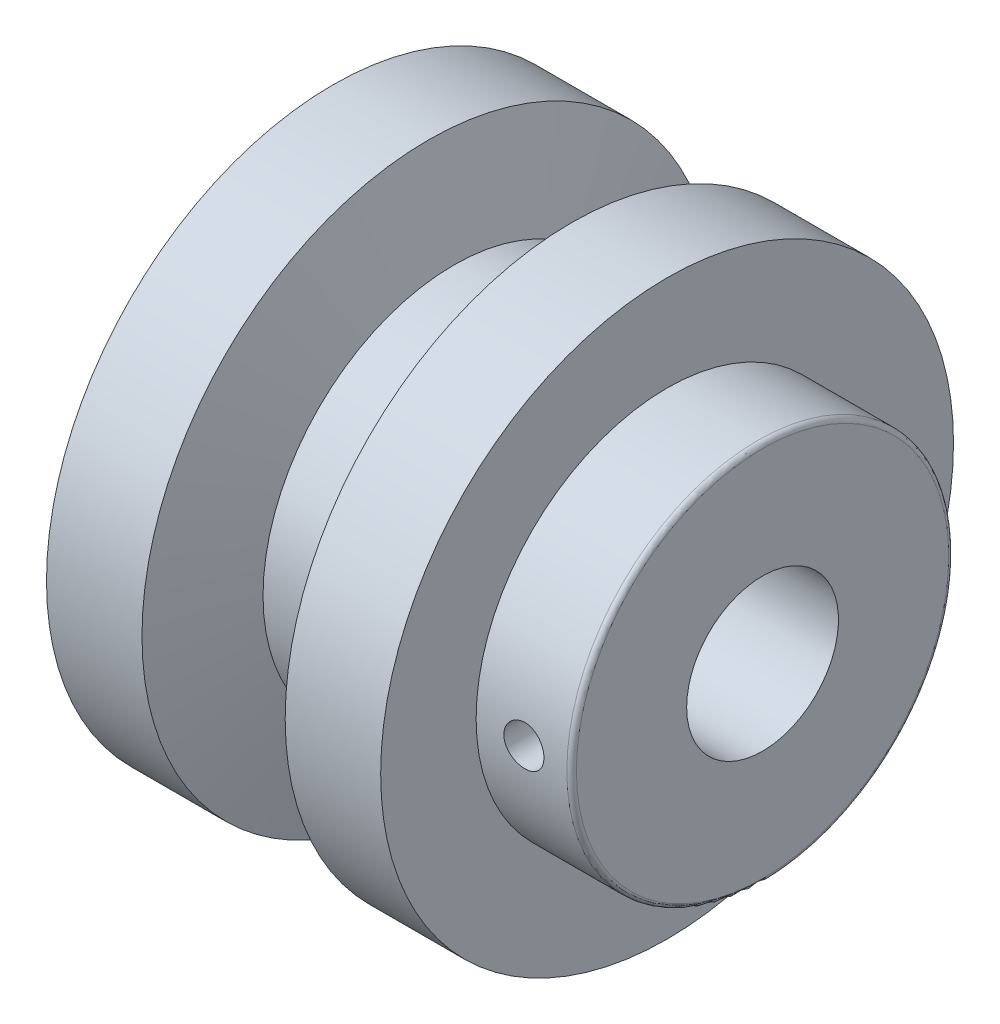
ISO-10303-21;
HEADER;
FILE_DESCRIPTION(('STEP AP214'),'2;1');
FILE_NAME('part.step','',(''),(''),'','','');
FILE_SCHEMA(('AUTOMOTIVE_DESIGN { 1 0 10303 214 1 1 1 1 }'));
ENDSEC;
DATA;
#1=APPLICATION_CONTEXT('core data for automotive mechanical design processes');
#2=APPLICATION_PROTOCOL_DEFINITION('international standard','automotive_design',2000,#1);
#3=PRODUCT_CONTEXT('',#1,'mechanical');
#4=PRODUCT('Part','Part','',(#3));
#5=PRODUCT_RELATED_PRODUCT_CATEGORY('part','',(#4));
#6=PRODUCT_DEFINITION_FORMATION('','',#4);
#7=PRODUCT_DEFINITION_CONTEXT('part definition',#1,'design');
#8=PRODUCT_DEFINITION('design','',#6,#7);
#9=PRODUCT_DEFINITION_SHAPE('','',#8);
#10=(LENGTH_UNIT() NAMED_UNIT(*) SI_UNIT(.MILLI.,.METRE.));
#11=(NAMED_UNIT(*) PLANE_ANGLE_UNIT() SI_UNIT($,.RADIAN.));
#12=(NAMED_UNIT(*) SI_UNIT($,.STERADIAN.) SOLID_ANGLE_UNIT());
#13=UNCERTAINTY_MEASURE_WITH_UNIT(LENGTH_MEASURE(1.E-05),#10,'distance_accuracy_value','');
#14=(GEOMETRIC_REPRESENTATION_CONTEXT(3) GLOBAL_UNCERTAINTY_ASSIGNED_CONTEXT((#13)) GLOBAL_UNIT_ASSIGNED_CONTEXT((#10,
#11,#12)) REPRESENTATION_CONTEXT('',''));
#15=CARTESIAN_POINT('',(0.,0.,0.));
#16=DIRECTION('',(0.,0.,1.));
#17=DIRECTION('',(1.,0.,0.));
#18=AXIS2_PLACEMENT_3D('',#15,#16,#17);
#19=CARTESIAN_POINT('',(2.5,0.,0.));
#20=DIRECTION('',(-1.,0.,0.));
#21=DIRECTION('',(0.,0.,1.));
#22=AXIS2_PLACEMENT_3D('',#19,#20,#21);
#23=CONICAL_SURFACE('',#22,7.95000000000001,1.32581766366803);
#24=CARTESIAN_POINT('',(0.,0.,0.));
#25=DIRECTION('',(-1.,0.,0.));
#26=DIRECTION('',(0.,0.,1.));
#27=AXIS2_PLACEMENT_3D('',#24,#25,#26);
#28=CIRCLE('',#27,17.95);
#29=CARTESIAN_POINT('',(0.,0.,17.95));
#30=VERTEX_POINT('',#29);
#31=EDGE_CURVE('E10',#30,#30,#28,.T.);
#32=ORIENTED_EDGE('',*,*,#31,.T.);
#33=EDGE_LOOP('',(#32));
#34=FACE_BOUND('',#33,.T.);
#35=CARTESIAN_POINT('',(2.5,0.,0.));
#36=DIRECTION('',(-1.,0.,0.));
#37=DIRECTION('',(0.,0.,1.));
#38=AXIS2_PLACEMENT_3D('',#35,#36,#37);
#39=CIRCLE('',#38,7.95000000000001);
#40=CARTESIAN_POINT('',(2.5,0.,7.95000000000001));
#41=VERTEX_POINT('',#40);
#42=EDGE_CURVE('E77',#41,#41,#39,.T.);
#43=ORIENTED_EDGE('',*,*,#42,.F.);
#44=EDGE_LOOP('',(#43));
#45=FACE_BOUND('',#44,.T.);
#46=ADVANCED_FACE('F33',(#34,#45),#23,.F.);
#47=CARTESIAN_POINT('',(0.,-17.95,0.));
#48=DIRECTION('',(-1.,0.,0.));
#49=DIRECTION('',(0.,0.,1.));
#50=AXIS2_PLACEMENT_3D('',#47,#48,#49);
#51=PLANE('',#50);
#52=CARTESIAN_POINT('',(0.,0.,0.));
#53=DIRECTION('',(-1.,0.,0.));
#54=DIRECTION('',(0.,0.,1.));
#55=AXIS2_PLACEMENT_3D('',#52,#53,#54);
#56=CIRCLE('',#55,30.);
#57=CARTESIAN_POINT('',(0.,0.,30.));
#58=VERTEX_POINT('',#57);
#59=EDGE_CURVE('E44',#58,#58,#56,.T.);
#60=ORIENTED_EDGE('',*,*,#59,.T.);
#61=EDGE_LOOP('',(#60));
#62=FACE_BOUND('',#61,.T.);
#63=ORIENTED_EDGE('',*,*,#31,.F.);
#64=EDGE_LOOP('',(#63));
#65=FACE_BOUND('',#64,.T.);
#66=ADVANCED_FACE('F100',(#62,#65),#51,.T.);
#67=CARTESIAN_POINT('',(0.,0.,0.));
#68=DIRECTION('',(-1.,0.,0.));
#69=DIRECTION('',(0.,0.,1.));
#70=AXIS2_PLACEMENT_3D('',#67,#68,#69);
#71=CYLINDRICAL_SURFACE('',#70,30.);
#72=CARTESIAN_POINT('',(10.,0.,0.));
#73=DIRECTION('',(-1.,0.,0.));
#74=DIRECTION('',(0.,0.,1.));
#75=AXIS2_PLACEMENT_3D('',#72,#73,#74);
#76=CIRCLE('',#75,30.);
#77=CARTESIAN_POINT('',(10.,0.,30.));
#78=VERTEX_POINT('',#77);
#79=EDGE_CURVE('E48',#78,#78,#76,.T.);
#80=ORIENTED_EDGE('',*,*,#79,.T.);
#81=EDGE_LOOP('',(#80));
#82=FACE_BOUND('',#81,.T.);
#83=ORIENTED_EDGE('',*,*,#59,.F.);
#84=EDGE_LOOP('',(#83));
#85=FACE_BOUND('',#84,.T.);
#86=ADVANCED_FACE('F104',(#82,#85),#71,.T.);
#87=CARTESIAN_POINT('',(10.,0.,0.));
#88=DIRECTION('',(-1.,0.,0.));
#89=DIRECTION('',(0.,0.,1.));
#90=AXIS2_PLACEMENT_3D('',#87,#88,#89);
#91=CONICAL_SURFACE('',#90,30.,1.30899693899575);
#92=CARTESIAN_POINT('',(12.6794919243112,0.,0.));
#93=DIRECTION('',(-1.,0.,0.));
#94=DIRECTION('',(0.,0.,1.));
#95=AXIS2_PLACEMENT_3D('',#92,#93,#94);
#96=CIRCLE('',#95,20.);
#97=CARTESIAN_POINT('',(12.6794919243112,0.,20.));
#98=VERTEX_POINT('',#97);
#99=EDGE_CURVE('E53',#98,#98,#96,.T.);
#100=ORIENTED_EDGE('',*,*,#99,.T.);
#101=EDGE_LOOP('',(#100));
#102=FACE_BOUND('',#101,.T.);
#103=ORIENTED_EDGE('',*,*,#79,.F.);
#104=EDGE_LOOP('',(#103));
#105=FACE_BOUND('',#104,.T.);
#106=ADVANCED_FACE('F149',(#102,#105),#91,.T.);
#107=CARTESIAN_POINT('',(0.,0.,0.));
#108=DIRECTION('',(-1.,0.,0.));
#109=DIRECTION('',(0.,0.,1.));
#110=AXIS2_PLACEMENT_3D('',#107,#108,#109);
#111=CYLINDRICAL_SURFACE('',#110,20.);
#112=CARTESIAN_POINT('',(22.3205080756888,0.,0.));
#113=DIRECTION('',(-1.,0.,0.));
#114=DIRECTION('',(0.,0.,1.));
#115=AXIS2_PLACEMENT_3D('',#112,#113,#114);
#116=CIRCLE('',#115,20.);
#117=CARTESIAN_POINT('',(22.3205080756888,0.,20.));
#118=VERTEX_POINT('',#117);
#119=EDGE_CURVE('E56',#118,#118,#116,.T.);
#120=ORIENTED_EDGE('',*,*,#119,.T.);
#121=EDGE_LOOP('',(#120));
#122=FACE_BOUND('',#121,.T.);
#123=ORIENTED_EDGE('',*,*,#99,.F.);
#124=EDGE_LOOP('',(#123));
#125=FACE_BOUND('',#124,.T.);
#126=ADVANCED_FACE('F143',(#122,#125),#111,.T.);
#127=CARTESIAN_POINT('',(22.3205080756888,0.,0.));
#128=DIRECTION('',(1.,0.,0.));
#129=DIRECTION('',(0.,0.,-1.));
#130=AXIS2_PLACEMENT_3D('',#127,#128,#129);
#131=CONICAL_SURFACE('',#130,20.,1.30899693899575);
#132=CARTESIAN_POINT('',(25.,0.,0.));
#133=DIRECTION('',(-1.,0.,0.));
#134=DIRECTION('',(0.,0.,1.));
#135=AXIS2_PLACEMENT_3D('',#132,#133,#134);
#136=CIRCLE('',#135,30.);
#137=CARTESIAN_POINT('',(25.,0.,30.));
#138=VERTEX_POINT('',#137);
#139=EDGE_CURVE('E59',#138,#138,#136,.T.);
#140=ORIENTED_EDGE('',*,*,#139,.T.);
#141=EDGE_LOOP('',(#140));
#142=FACE_BOUND('',#141,.T.);
#143=ORIENTED_EDGE('',*,*,#119,.F.);
#144=EDGE_LOOP('',(#143));
#145=FACE_BOUND('',#144,.T.);
#146=ADVANCED_FACE('F137',(#142,#145),#131,.T.);
#147=CARTESIAN_POINT('',(0.,0.,0.));
#148=DIRECTION('',(-1.,0.,0.));
#149=DIRECTION('',(0.,0.,1.));
#150=AXIS2_PLACEMENT_3D('',#147,#148,#149);
#151=CYLINDRICAL_SURFACE('',#150,30.);
#152=CARTESIAN_POINT('',(35.,0.,0.));
#153=DIRECTION('',(-1.,0.,0.));
#154=DIRECTION('',(0.,0.,1.));
#155=AXIS2_PLACEMENT_3D('',#152,#153,#154);
#156=CIRCLE('',#155,30.);
#157=CARTESIAN_POINT('',(35.,0.,30.));
#158=VERTEX_POINT('',#157);
#159=EDGE_CURVE('E62',#158,#158,#156,.T.);
#160=ORIENTED_EDGE('',*,*,#159,.T.);
#161=EDGE_LOOP('',(#160));
#162=FACE_BOUND('',#161,.T.);
#163=ORIENTED_EDGE('',*,*,#139,.F.);
#164=EDGE_LOOP('',(#163));
#165=FACE_BOUND('',#164,.T.);
#166=ADVANCED_FACE('F131',(#162,#165),#151,.T.);
#167=CARTESIAN_POINT('',(35.,-30.,0.));
#168=DIRECTION('',(1.,0.,0.));
#169=DIRECTION('',(0.,0.,-1.));
#170=AXIS2_PLACEMENT_3D('',#167,#168,#169);
#171=PLANE('',#170);
#172=CARTESIAN_POINT('',(35.,0.,0.));
#173=DIRECTION('',(-1.,0.,0.));
#174=DIRECTION('',(0.,0.,1.));
#175=AXIS2_PLACEMENT_3D('',#172,#173,#174);
#176=CIRCLE('',#175,20.);
#177=CARTESIAN_POINT('',(35.,0.,20.));
#178=VERTEX_POINT('',#177);
#179=EDGE_CURVE('E65',#178,#178,#176,.T.);
#180=ORIENTED_EDGE('',*,*,#179,.T.);
#181=EDGE_LOOP('',(#180));
#182=FACE_BOUND('',#181,.T.);
#183=ORIENTED_EDGE('',*,*,#159,.F.);
#184=EDGE_LOOP('',(#183));
#185=FACE_BOUND('',#184,.T.);
#186=ADVANCED_FACE('F125',(#182,#185),#171,.T.);
#187=CARTESIAN_POINT('',(0.,0.,0.));
#188=DIRECTION('',(-1.,0.,0.));
#189=DIRECTION('',(0.,0.,1.));
#190=AXIS2_PLACEMENT_3D('',#187,#188,#189);
#191=CYLINDRICAL_SURFACE('',#190,20.);
#192=CARTESIAN_POINT('',(42.1,0.,20.));
#193=CARTESIAN_POINT('',(42.0999949230642,0.117610574556953,19.9999985861225));
#194=CARTESIAN_POINT('',(42.0900865495256,0.235298131378431,19.9989515701418));
#195=CARTESIAN_POINT('',(42.0507109273298,0.467408281963046,19.9948755007952));
#196=CARTESIAN_POINT('',(42.02122233536,0.581827170618682,19.9918442846137));
#197=CARTESIAN_POINT('',(41.9435561221623,0.804005356961036,19.9841418596598));
#198=CARTESIAN_POINT('',(41.8953900254574,0.911768713849167,19.9794716623513));
#199=CARTESIAN_POINT('',(41.7817589762977,1.11765859904565,19.9690129744413));
#200=CARTESIAN_POINT('',(41.7162973770353,1.2157869902952,19.963224700667));
#201=CARTESIAN_POINT('',(41.569656435472,1.40003175469819,19.9511523144024));
#202=CARTESIAN_POINT('',(41.4884226842205,1.48610471828674,19.944866531453));
#203=CARTESIAN_POINT('',(41.3126596136441,1.64342207671848,19.9325213225088));
#204=CARTESIAN_POINT('',(41.2181296688171,1.71466577354684,19.9264619071801));
#205=CARTESIAN_POINT('',(41.0181837270879,1.84045763756347,19.915238578931));
#206=CARTESIAN_POINT('',(40.9127427088117,1.89496624010398,19.9100768004705));
#207=CARTESIAN_POINT('',(40.6941409242799,1.98548798456523,19.9012541874175));
#208=CARTESIAN_POINT('',(40.5809803672551,2.02150162754854,19.8975933121633));
#209=CARTESIAN_POINT('',(40.3505961431444,2.07388179744853,19.8922022962288));
#210=CARTESIAN_POINT('',(40.2333890784955,2.09032060381388,19.890465054272));
#211=CARTESIAN_POINT('',(39.9978676604021,2.10330793490494,19.889096025595));
#212=CARTESIAN_POINT('',(39.8795533389603,2.09985703273741,19.8894641782095));
#213=CARTESIAN_POINT('',(39.6456751550686,2.07322243378021,19.8922578534938));
#214=CARTESIAN_POINT('',(39.5301021784106,2.05011778256066,19.8946751346228));
#215=CARTESIAN_POINT('',(39.3044833478823,1.98495459652899,19.9012818323377));
#216=CARTESIAN_POINT('',(39.1944375755754,1.94289578210746,19.9054712750662));
#217=CARTESIAN_POINT('',(38.98274800286,1.84093133329276,19.9151597133922));
#218=CARTESIAN_POINT('',(38.8811211529613,1.78099076082822,19.9206612683861));
#219=CARTESIAN_POINT('',(38.6893397702597,1.64498937257378,19.9323519192806));
#220=CARTESIAN_POINT('',(38.5991856079598,1.56892803638547,19.9385410373735));
#221=CARTESIAN_POINT('',(38.4324495098156,1.40240335664829,19.9509461711086));
#222=CARTESIAN_POINT('',(38.3559357115762,1.31187177127052,19.9571621711798));
#223=CARTESIAN_POINT('',(38.2191808453474,1.11921304858704,19.968892312137));
#224=CARTESIAN_POINT('',(38.1589397985622,1.01708589617182,19.9744064521086));
#225=CARTESIAN_POINT('',(38.0564426844708,0.804086871738412,19.9841136624366));
#226=CARTESIAN_POINT('',(38.014190221792,0.693213252337614,19.9883064679749));
#227=CARTESIAN_POINT('',(37.9489203604243,0.465891500761023,19.9948959572163));
#228=CARTESIAN_POINT('',(37.9259023273658,0.349443552565789,19.9972927001549));
#229=CARTESIAN_POINT('',(37.89984150458,0.114868577013524,20.0000123913183));
#230=CARTESIAN_POINT('',(37.8967047198591,-0.00324789921030697,20.0003450977805));
#231=CARTESIAN_POINT('',(37.9102483450366,-0.238324864201357,19.9989254280681));
#232=CARTESIAN_POINT('',(37.9269284592536,-0.355285370190176,19.997173083004));
#233=CARTESIAN_POINT('',(37.9795543943113,-0.584457914380878,19.9917864257121));
#234=CARTESIAN_POINT('',(38.0154560569179,-0.696680202830055,19.9881564277171));
#235=CARTESIAN_POINT('',(38.1054604957932,-0.913509726654129,19.9794215373593));
#236=CARTESIAN_POINT('',(38.1595637194972,-1.01811677475236,19.9743166087399));
#237=CARTESIAN_POINT('',(38.284667555895,-1.21717044721087,19.9631781959612));
#238=CARTESIAN_POINT('',(38.3557297509654,-1.31157817667962,19.9571413566863));
#239=CARTESIAN_POINT('',(38.5126462530323,-1.48715924360521,19.9448268762315));
#240=CARTESIAN_POINT('',(38.5985009701211,-1.568332214034,19.9385492283796));
#241=CARTESIAN_POINT('',(38.7829762753991,-1.71546723142882,19.9264311606195));
#242=CARTESIAN_POINT('',(38.8816462956563,-1.78136747427046,19.9205925796686));
#243=CARTESIAN_POINT('',(39.0887082401009,-1.8956611208723,19.9100421218507));
#244=CARTESIAN_POINT('',(39.1971000196201,-1.94405478509178,19.9053302282213));
#245=CARTESIAN_POINT('',(39.4203189781473,-2.02185870687172,19.8975783355781));
#246=CARTESIAN_POINT('',(39.5351333467435,-2.0513053846878,19.8945351306546));
#247=CARTESIAN_POINT('',(39.7681105197299,-2.09049747040514,19.8904553699829));
#248=CARTESIAN_POINT('',(39.8862732172086,-2.10024350662607,19.8894187502379));
#249=CARTESIAN_POINT('',(40.1219784686339,-2.09974842606065,19.8894709750246));
#250=CARTESIAN_POINT('',(40.2395212407998,-2.0896043940762,19.8905494954156));
#251=CARTESIAN_POINT('',(40.4712226791796,-2.04982105883557,19.8946884320046));
#252=CARTESIAN_POINT('',(40.5853813421239,-2.02018173674434,19.8977488501174));
#253=CARTESIAN_POINT('',(40.8070710411124,-1.94227663661315,19.9055038265572));
#254=CARTESIAN_POINT('',(40.9146032094297,-1.89401405103289,19.9101981047892));
#255=CARTESIAN_POINT('',(41.1200565415963,-1.78024229516215,19.9206924240923));
#256=CARTESIAN_POINT('',(41.2179777270863,-1.71473316370626,19.9264924626736));
#257=CARTESIAN_POINT('',(41.4019269252103,-1.56796388588165,19.9385787157003));
#258=CARTESIAN_POINT('',(41.4878970396921,-1.4866313492115,19.9448670815623));
#259=CARTESIAN_POINT('',(41.6450103088069,-1.3106694114521,19.9572018929493));
#260=CARTESIAN_POINT('',(41.716149918128,-1.21603683994904,19.9632482803496));
#261=CARTESIAN_POINT('',(41.8417393164674,-1.01587362585845,19.9744353744075));
#262=CARTESIAN_POINT('',(41.896142755599,-0.910313780947588,19.9795735493958));
#263=CARTESIAN_POINT('',(41.9863785506049,-0.6915689731673,19.9883382268768));
#264=CARTESIAN_POINT('',(42.0222317076953,-0.578392712609078,19.9919664216767));
#265=CARTESIAN_POINT('',(42.0654739129788,-0.387154461046656,19.9963973899639));
#266=CARTESIAN_POINT('',(42.0784033405654,-0.31031218759518,19.9977420180587));
#267=CARTESIAN_POINT('',(42.0956680442412,-0.15565784850026,19.9995437889269));
#268=CARTESIAN_POINT('',(42.1000033603957,-0.0778457873796145,20.0000009358377));
#269=CARTESIAN_POINT('',(42.1,0.,20.));
#270=B_SPLINE_CURVE_WITH_KNOTS('',3,(#192,#193,#194,#195,#196,#197,#198,#199,#200,#201,#202,
#203,#204,#205,#206,#207,#208,#209,#210,#211,#212,#213,#214,#215,#216,#217,#218,#219,#220,#221,
#222,#223,#224,#225,#226,#227,#228,#229,#230,#231,#232,#233,#234,#235,#236,#237,#238,#239,#240,
#241,#242,#243,#244,#245,#246,#247,#248,#249,#250,#251,#252,#253,#254,#255,#256,#257,#258,#259,
#260,#261,#262,#263,#264,#265,#266,#267,#268,#269),.UNSPECIFIED.,.T.,.F.,(4,2,2,2,2,2,2,2,2,2,2,
2,2,2,2,2,2,2,2,2,2,2,2,2,2,2,2,2,2,2,2,2,2,2,2,2,2,2,4),(0.,0.352547445376477,
0.705479815473271,1.05819476242917,1.41084137634127,1.76472684686618,2.11862897104477,
2.47336144998343,2.82808431805778,3.18149328120567,3.53489206119518,3.88687618772919,
4.2388655068582,4.59154711145463,4.94424010278874,5.29864833369555,5.65305702641606,
6.00753670363998,6.36200468932826,6.71479555573138,7.06758115832307,7.41955975201311,
7.77154699876239,8.1248323890423,8.47812757501262,8.83282840430148,9.18752395620732,
9.54153565252773,9.89553605804704,10.2478128639806,10.6000900102609,10.9523067948682,
11.3045227863845,11.6583897165679,12.0123411437847,12.3672641737055,12.7217883461217,
12.9551386339019,13.1884878338135),.UNSPECIFIED.);
#271=CARTESIAN_POINT('',(42.1,0.,20.));
#272=VERTEX_POINT('',#271);
#273=EDGE_CURVE('E36',#272,#272,#270,.T.);
#274=ORIENTED_EDGE('',*,*,#273,.F.);
#275=EDGE_LOOP('',(#274));
#276=FACE_BOUND('',#275,.T.);
#277=CARTESIAN_POINT('',(44.5,0.,0.));
#278=DIRECTION('',(-1.,0.,0.));
#279=DIRECTION('',(0.,0.,1.));
#280=AXIS2_PLACEMENT_3D('',#277,#278,#279);
#281=CIRCLE('',#280,20.);
#282=CARTESIAN_POINT('',(44.5,0.,20.));
#283=VERTEX_POINT('',#282);
#284=EDGE_CURVE('E68',#283,#283,#281,.T.);
#285=ORIENTED_EDGE('',*,*,#284,.T.);
#286=EDGE_LOOP('',(#285));
#287=FACE_BOUND('',#286,.T.);
#288=ORIENTED_EDGE('',*,*,#179,.F.);
#289=EDGE_LOOP('',(#288));
#290=FACE_BOUND('',#289,.T.);
#291=ADVANCED_FACE('F119',(#276,#287,#290),#191,.T.);
#292=CARTESIAN_POINT('',(44.5,0.,0.));
#293=DIRECTION('',(-1.,0.,0.));
#294=DIRECTION('',(0.,0.,1.));
#295=AXIS2_PLACEMENT_3D('',#292,#293,#294);
#296=TOROIDAL_SURFACE('',#295,19.5,0.500000000000002);
#297=CARTESIAN_POINT('',(45.,0.,0.));
#298=DIRECTION('',(-1.,0.,0.));
#299=DIRECTION('',(0.,0.,1.));
#300=AXIS2_PLACEMENT_3D('',#297,#298,#299);
#301=CIRCLE('',#300,19.5);
#302=CARTESIAN_POINT('',(45.,0.,19.5));
#303=VERTEX_POINT('',#302);
#304=EDGE_CURVE('E71',#303,#303,#301,.T.);
#305=ORIENTED_EDGE('',*,*,#304,.T.);
#306=EDGE_LOOP('',(#305));
#307=FACE_BOUND('',#306,.T.);
#308=ORIENTED_EDGE('',*,*,#284,.F.);
#309=EDGE_LOOP('',(#308));
#310=FACE_BOUND('',#309,.T.);
#311=ADVANCED_FACE('F114',(#307,#310),#296,.T.);
#312=CARTESIAN_POINT('',(45.,-19.5,0.));
#313=DIRECTION('',(1.,0.,0.));
#314=DIRECTION('',(0.,0.,-1.));
#315=AXIS2_PLACEMENT_3D('',#312,#313,#314);
#316=PLANE('',#315);
#317=CARTESIAN_POINT('',(45.,0.,0.));
#318=DIRECTION('',(-1.,0.,0.));
#319=DIRECTION('',(0.,0.,1.));
#320=AXIS2_PLACEMENT_3D('',#317,#318,#319);
#321=CIRCLE('',#320,7.95);
#322=CARTESIAN_POINT('',(45.,0.,7.95));
#323=VERTEX_POINT('',#322);
#324=EDGE_CURVE('E74',#323,#323,#321,.T.);
#325=ORIENTED_EDGE('',*,*,#324,.T.);
#326=EDGE_LOOP('',(#325));
#327=FACE_BOUND('',#326,.T.);
#328=ORIENTED_EDGE('',*,*,#304,.F.);
#329=EDGE_LOOP('',(#328));
#330=FACE_BOUND('',#329,.T.);
#331=ADVANCED_FACE('F96',(#327,#330),#316,.T.);
#332=CARTESIAN_POINT('',(0.,0.,0.));
#333=DIRECTION('',(-1.,0.,0.));
#334=DIRECTION('',(0.,0.,1.));
#335=AXIS2_PLACEMENT_3D('',#332,#333,#334);
#336=CYLINDRICAL_SURFACE('',#335,7.95);
#337=CARTESIAN_POINT('',(42.1,0.,7.95));
#338=CARTESIAN_POINT('',(42.0999971691389,-0.115807382806724,7.94999821620059));
#339=CARTESIAN_POINT('',(42.0903883308429,-0.231645292563856,7.94744460662686));
#340=CARTESIAN_POINT('',(42.0522732627495,-0.459986786537607,7.93750566369272));
#341=CARTESIAN_POINT('',(42.0237576895646,-0.572488693425965,7.93011794141953));
#342=CARTESIAN_POINT('',(41.9488189354009,-0.790828943436415,7.91132659563508));
#343=CARTESIAN_POINT('',(41.9024185999153,-0.896675587990456,7.89992809698844));
#344=CARTESIAN_POINT('',(41.7931114844476,-1.09908426636459,7.87432125460492));
#345=CARTESIAN_POINT('',(41.7302036869794,-1.19564572736346,7.86011273767758));
#346=CARTESIAN_POINT('',(41.588153778649,-1.37894341080356,7.83005917788751));
#347=CARTESIAN_POINT('',(41.508705560958,-1.46543789789191,7.81418657741264));
#348=CARTESIAN_POINT('',(41.3364845739912,-1.62404314211897,7.78277168083888));
#349=CARTESIAN_POINT('',(41.2437101257915,-1.69615208413575,7.76722942664279));
#350=CARTESIAN_POINT('',(41.0455487904755,-1.82511151837723,7.73795371780714));
#351=CARTESIAN_POINT('',(40.9399760843985,-1.88168510309416,7.72425506579675));
#352=CARTESIAN_POINT('',(40.7203973602113,-1.97618477895645,7.70062224296611));
#353=CARTESIAN_POINT('',(40.6063928690149,-2.01411423690472,7.69068739254353));
#354=CARTESIAN_POINT('',(40.3758610233236,-2.06941173927645,7.67599135240771));
#355=CARTESIAN_POINT('',(40.2594458438713,-2.08721750788937,7.67112021525982));
#356=CARTESIAN_POINT('',(40.0251866393057,-2.10312667265487,7.66677454401155));
#357=CARTESIAN_POINT('',(39.907342879705,-2.101233675556,7.66729902199999));
#358=CARTESIAN_POINT('',(39.676978588742,-2.07814682072559,7.67358684974892));
#359=CARTESIAN_POINT('',(39.5644005654992,-2.05748136544249,7.67920676621486));
#360=CARTESIAN_POINT('',(39.3443691202789,-1.99828199079706,7.69482275192771));
#361=CARTESIAN_POINT('',(39.2369161017443,-1.959746667262,7.70481916506611));
#362=CARTESIAN_POINT('',(39.0288014113751,-1.86546782323779,7.72818877596084));
#363=CARTESIAN_POINT('',(38.9282283558323,-1.80953805207232,7.74159822198135));
#364=CARTESIAN_POINT('',(38.7377087453178,-1.68218793750119,7.77026335595926));
#365=CARTESIAN_POINT('',(38.6477642517857,-1.61076459666676,7.78551940091199));
#366=CARTESIAN_POINT('',(38.478034556352,-1.45174756320735,7.81675687063748));
#367=CARTESIAN_POINT('',(38.3986662151815,-1.36370980450463,7.83274589072654));
#368=CARTESIAN_POINT('',(38.2557355379656,-1.17537908142774,7.8632098823484));
#369=CARTESIAN_POINT('',(38.1921738019127,-1.07508565206415,7.87768479639617));
#370=CARTESIAN_POINT('',(38.0824818456984,-0.864452867570889,7.9035759391553));
#371=CARTESIAN_POINT('',(38.0364258647925,-0.754073137062092,7.91497908275098));
#372=CARTESIAN_POINT('',(37.9636433892977,-0.526768004929944,7.93334720048184));
#373=CARTESIAN_POINT('',(37.9369127527837,-0.409844011704171,7.94031312559055));
#374=CARTESIAN_POINT('',(37.9041915030776,-0.176327971117036,7.9488785973914));
#375=CARTESIAN_POINT('',(37.8976339930552,-0.0598206190113495,7.95062478598648));
#376=CARTESIAN_POINT('',(37.903881240716,0.172628722869454,7.94897503075217));
#377=CARTESIAN_POINT('',(37.9166840374905,0.288570768708414,7.94557960769088));
#378=CARTESIAN_POINT('',(37.9608231163475,0.514583255005546,7.93412274667763));
#379=CARTESIAN_POINT('',(37.9918442741055,0.624719630397343,7.92614069348398));
#380=CARTESIAN_POINT('',(38.0711744887838,0.838215344063623,7.90641504665772));
#381=CARTESIAN_POINT('',(38.1194854008231,0.941573953703272,7.89467104939828));
#382=CARTESIAN_POINT('',(38.2330825358059,1.14079109395833,7.86837941327792));
#383=CARTESIAN_POINT('',(38.2986785697374,1.23646623396768,7.85378201022015));
#384=CARTESIAN_POINT('',(38.4445934361907,1.41565042533356,7.82347148753417));
#385=CARTESIAN_POINT('',(38.5249151201529,1.49915711478918,7.80775815218109));
#386=CARTESIAN_POINT('',(38.7006448463577,1.65401470228984,7.77644900723652));
#387=CARTESIAN_POINT('',(38.7964084200478,1.72496596287852,7.76086844203153));
#388=CARTESIAN_POINT('',(38.9988108233363,1.84979861894935,7.73206730914054));
#389=CARTESIAN_POINT('',(39.1054491926103,1.90368073656298,7.71884664162644));
#390=CARTESIAN_POINT('',(39.3260342704648,1.99243995106985,7.69641344360876));
#391=CARTESIAN_POINT('',(39.4399339482206,2.0274277296647,7.68717763561472));
#392=CARTESIAN_POINT('',(39.6722846630812,2.07767205105542,7.67375188651386));
#393=CARTESIAN_POINT('',(39.7907345560043,2.09293352115055,7.6695606853673));
#394=CARTESIAN_POINT('',(40.0247357846781,2.10301252442315,7.66680254212125));
#395=CARTESIAN_POINT('',(40.140257815778,2.09847180627003,7.66805904323893));
#396=CARTESIAN_POINT('',(40.368826102702,2.07056088297564,7.67564215589366));
#397=CARTESIAN_POINT('',(40.4818724199108,2.04719114523976,7.68196864157506));
#398=CARTESIAN_POINT('',(40.7014896378864,1.98265437323236,7.6988748121854));
#399=CARTESIAN_POINT('',(40.8081024225884,1.94162090954612,7.7094225354386));
#400=CARTESIAN_POINT('',(41.0130104226269,1.84302544203296,7.73358403717556));
#401=CARTESIAN_POINT('',(41.1113043528182,1.78546089039956,7.74719828820932));
#402=CARTESIAN_POINT('',(41.2998535812344,1.65348199254709,7.77645060072742));
#403=CARTESIAN_POINT('',(41.3897942662212,1.57862856797443,7.79213579766424));
#404=CARTESIAN_POINT('',(41.5560466227199,1.41503498332637,7.82349670747433));
#405=CARTESIAN_POINT('',(41.6323549885495,1.32629146482225,7.83917241713112));
#406=CARTESIAN_POINT('',(41.7707402250849,1.13520174997617,7.86913922475073));
#407=CARTESIAN_POINT('',(41.8324868332817,1.03261031031865,7.88339459649824));
#408=CARTESIAN_POINT('',(41.9377593431831,0.818131106163278,7.90852600441193));
#409=CARTESIAN_POINT('',(41.9812971501875,0.70624947333129,7.91940424741342));
#410=CARTESIAN_POINT('',(42.0431152840387,0.49562394301071,7.93511757264896));
#411=CARTESIAN_POINT('',(42.064398047614,0.397803291615569,7.94065817882416));
#412=CARTESIAN_POINT('',(42.0928409584036,0.199995878041483,7.94809999019077));
#413=CARTESIAN_POINT('',(42.1000024446844,0.100009322156075,7.95000154045939));
#414=CARTESIAN_POINT('',(42.1,0.,7.95));
#415=B_SPLINE_CURVE_WITH_KNOTS('',3,(#337,#338,#339,#340,#341,#342,#343,#344,#345,#346,#347,
#348,#349,#350,#351,#352,#353,#354,#355,#356,#357,#358,#359,#360,#361,#362,#363,#364,#365,#366,
#367,#368,#369,#370,#371,#372,#373,#374,#375,#376,#377,#378,#379,#380,#381,#382,#383,#384,#385,
#386,#387,#388,#389,#390,#391,#392,#393,#394,#395,#396,#397,#398,#399,#400,#401,#402,#403,#404,
#405,#406,#407,#408,#409,#410,#411,#412,#413,#414),.UNSPECIFIED.,.T.,.F.,(4,2,2,2,2,2,2,2,2,2,2,
2,2,2,2,2,2,2,2,2,2,2,2,2,2,2,2,2,2,2,2,2,2,2,2,2,2,2,4),(0.,0.347055429441539,
0.694282495745781,1.04106748602774,1.38787385645045,1.74178316498773,2.09573710046224,
2.45564173626923,2.81548135570097,3.16733341312838,3.51912104928261,3.86130346667391,
4.20351277652181,4.54952035078964,4.8955949244322,5.25273649568397,5.60989162136666,
5.96854492304496,6.32712133316391,6.67552461890663,7.02389261898423,7.36640531217845,
7.70895476659016,8.05811957007082,8.40735205655519,8.766234305638,9.12510136972911,
9.48184276157093,9.83849502819693,10.1836763303973,10.5288490641947,10.8714562790788,
11.2141163256814,11.5666842596439,11.9193375716193,12.2793510532404,12.6391287810477,
12.9388684796611,13.2385797537425),.UNSPECIFIED.);
#416=CARTESIAN_POINT('',(42.1,0.,7.95));
#417=VERTEX_POINT('',#416);
#418=EDGE_CURVE('E80',#417,#417,#415,.T.);
#419=ORIENTED_EDGE('',*,*,#418,.F.);
#420=EDGE_LOOP('',(#419));
#421=FACE_BOUND('',#420,.T.);
#422=ORIENTED_EDGE('',*,*,#42,.T.);
#423=EDGE_LOOP('',(#422));
#424=FACE_BOUND('',#423,.T.);
#425=ORIENTED_EDGE('',*,*,#324,.F.);
#426=EDGE_LOOP('',(#425));
#427=FACE_BOUND('',#426,.T.);
#428=ADVANCED_FACE('F85',(#421,#424,#427),#336,.F.);
#429=CARTESIAN_POINT('',(40.,0.,0.));
#430=DIRECTION('',(0.,0.,-1.));
#431=DIRECTION('',(-1.,0.,0.));
#432=AXIS2_PLACEMENT_3D('',#429,#430,#431);
#433=CYLINDRICAL_SURFACE('',#432,2.1);
#434=ORIENTED_EDGE('',*,*,#418,.T.);
#435=EDGE_LOOP('',(#434));
#436=FACE_BOUND('',#435,.T.);
#437=ORIENTED_EDGE('',*,*,#273,.T.);
#438=EDGE_LOOP('',(#437));
#439=FACE_BOUND('',#438,.T.);
#440=ADVANCED_FACE('F88',(#436,#439),#433,.F.);
#441=CLOSED_SHELL('',(#46,#66,#86,#106,#126,#146,#166,#186,#291,#311,#331,#428,#440));
#442=MANIFOLD_SOLID_BREP('B2',#441);
#443=ADVANCED_BREP_SHAPE_REPRESENTATION('',(#18,#442),#14);
#444=SHAPE_DEFINITION_REPRESENTATION(#9,#443);
ENDSEC;
END-ISO-10303-21;
